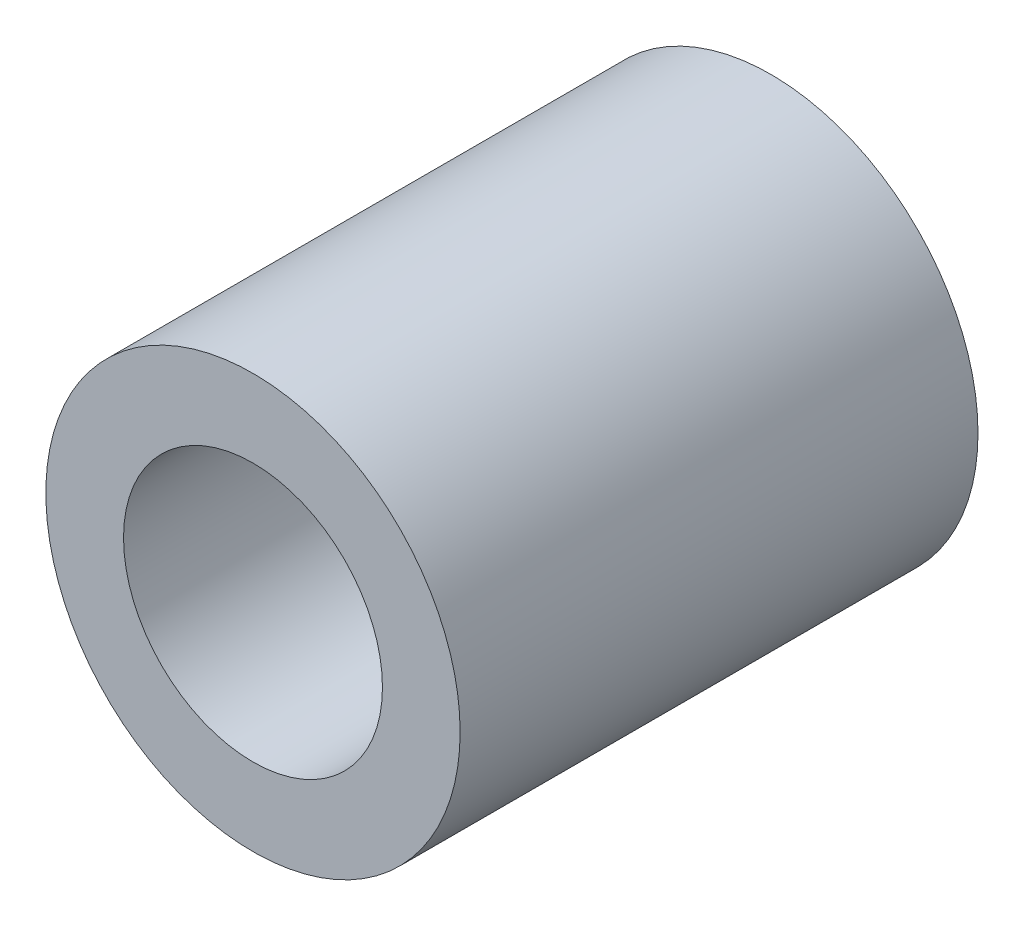
ISO-10303-21;
HEADER;
FILE_DESCRIPTION(('STEP AP214'),'2;1');
FILE_NAME('part.step','',(''),(''),'','','');
FILE_SCHEMA(('AUTOMOTIVE_DESIGN { 1 0 10303 214 1 1 1 1 }'));
ENDSEC;
DATA;
#1=APPLICATION_CONTEXT('core data for automotive mechanical design processes');
#2=APPLICATION_PROTOCOL_DEFINITION('international standard','automotive_design',2000,#1);
#3=PRODUCT_CONTEXT('',#1,'mechanical');
#4=PRODUCT('Part','Part','',(#3));
#5=PRODUCT_RELATED_PRODUCT_CATEGORY('part','',(#4));
#6=PRODUCT_DEFINITION_FORMATION('','',#4);
#7=PRODUCT_DEFINITION_CONTEXT('part definition',#1,'design');
#8=PRODUCT_DEFINITION('design','',#6,#7);
#9=PRODUCT_DEFINITION_SHAPE('','',#8);
#10=(LENGTH_UNIT() NAMED_UNIT(*) SI_UNIT(.MILLI.,.METRE.));
#11=(NAMED_UNIT(*) PLANE_ANGLE_UNIT() SI_UNIT($,.RADIAN.));
#12=(NAMED_UNIT(*) SI_UNIT($,.STERADIAN.) SOLID_ANGLE_UNIT());
#13=UNCERTAINTY_MEASURE_WITH_UNIT(LENGTH_MEASURE(1.E-05),#10,'distance_accuracy_value','');
#14=(GEOMETRIC_REPRESENTATION_CONTEXT(3) GLOBAL_UNCERTAINTY_ASSIGNED_CONTEXT((#13)) GLOBAL_UNIT_ASSIGNED_CONTEXT((#10,
#11,#12)) REPRESENTATION_CONTEXT('',''));
#15=CARTESIAN_POINT('',(0.,0.,0.));
#16=DIRECTION('',(0.,0.,1.));
#17=DIRECTION('',(1.,0.,0.));
#18=AXIS2_PLACEMENT_3D('',#15,#16,#17);
#19=CARTESIAN_POINT('',(0.,0.,10.));
#20=DIRECTION('',(0.,0.,1.));
#21=DIRECTION('',(1.,0.,0.));
#22=AXIS2_PLACEMENT_3D('',#19,#20,#21);
#23=PLANE('',#22);
#24=CARTESIAN_POINT('',(0.,0.,10.));
#25=DIRECTION('',(0.,0.,1.));
#26=DIRECTION('',(1.,0.,0.));
#27=AXIS2_PLACEMENT_3D('',#24,#25,#26);
#28=CIRCLE('',#27,4.);
#29=CARTESIAN_POINT('',(4.,0.,10.));
#30=VERTEX_POINT('',#29);
#31=EDGE_CURVE('E10',#30,#30,#28,.T.);
#32=ORIENTED_EDGE('',*,*,#31,.T.);
#33=EDGE_LOOP('',(#32));
#34=FACE_BOUND('',#33,.T.);
#35=CARTESIAN_POINT('',(0.,0.,10.));
#36=DIRECTION('',(0.,0.,1.));
#37=DIRECTION('',(1.,0.,0.));
#38=AXIS2_PLACEMENT_3D('',#35,#36,#37);
#39=CIRCLE('',#38,2.5);
#40=CARTESIAN_POINT('',(2.5,0.,10.));
#41=VERTEX_POINT('',#40);
#42=EDGE_CURVE('E42',#41,#41,#39,.T.);
#43=ORIENTED_EDGE('',*,*,#42,.F.);
#44=EDGE_LOOP('',(#43));
#45=FACE_BOUND('',#44,.T.);
#46=ADVANCED_FACE('F31',(#34,#45),#23,.T.);
#47=CARTESIAN_POINT('',(0.,0.,0.));
#48=DIRECTION('',(0.,0.,1.));
#49=DIRECTION('',(1.,0.,0.));
#50=AXIS2_PLACEMENT_3D('',#47,#48,#49);
#51=PLANE('',#50);
#52=CARTESIAN_POINT('',(0.,0.,0.));
#53=DIRECTION('',(0.,0.,1.));
#54=DIRECTION('',(1.,0.,0.));
#55=AXIS2_PLACEMENT_3D('',#52,#53,#54);
#56=CIRCLE('',#55,4.);
#57=CARTESIAN_POINT('',(4.,0.,0.));
#58=VERTEX_POINT('',#57);
#59=EDGE_CURVE('E35',#58,#58,#56,.T.);
#60=ORIENTED_EDGE('',*,*,#59,.F.);
#61=EDGE_LOOP('',(#60));
#62=FACE_BOUND('',#61,.T.);
#63=CARTESIAN_POINT('',(0.,0.,0.));
#64=DIRECTION('',(0.,0.,1.));
#65=DIRECTION('',(1.,0.,0.));
#66=AXIS2_PLACEMENT_3D('',#63,#64,#65);
#67=CIRCLE('',#66,2.5);
#68=CARTESIAN_POINT('',(2.5,0.,0.));
#69=VERTEX_POINT('',#68);
#70=EDGE_CURVE('E44',#69,#69,#67,.T.);
#71=ORIENTED_EDGE('',*,*,#70,.T.);
#72=EDGE_LOOP('',(#71));
#73=FACE_BOUND('',#72,.T.);
#74=ADVANCED_FACE('F54',(#62,#73),#51,.F.);
#75=CARTESIAN_POINT('',(0.,0.,10.));
#76=DIRECTION('',(0.,0.,-1.));
#77=DIRECTION('',(-1.,0.,0.));
#78=AXIS2_PLACEMENT_3D('',#75,#76,#77);
#79=CYLINDRICAL_SURFACE('',#78,4.);
#80=ORIENTED_EDGE('',*,*,#31,.F.);
#81=EDGE_LOOP('',(#80));
#82=FACE_BOUND('',#81,.T.);
#83=ORIENTED_EDGE('',*,*,#59,.T.);
#84=EDGE_LOOP('',(#83));
#85=FACE_BOUND('',#84,.T.);
#86=ADVANCED_FACE('F33',(#82,#85),#79,.T.);
#87=CARTESIAN_POINT('',(0.,0.,10.));
#88=DIRECTION('',(0.,0.,-1.));
#89=DIRECTION('',(-1.,0.,0.));
#90=AXIS2_PLACEMENT_3D('',#87,#88,#89);
#91=CYLINDRICAL_SURFACE('',#90,2.5);
#92=ORIENTED_EDGE('',*,*,#42,.T.);
#93=EDGE_LOOP('',(#92));
#94=FACE_BOUND('',#93,.T.);
#95=ORIENTED_EDGE('',*,*,#70,.F.);
#96=EDGE_LOOP('',(#95));
#97=FACE_BOUND('',#96,.T.);
#98=ADVANCED_FACE('F50',(#94,#97),#91,.F.);
#99=CLOSED_SHELL('',(#46,#74,#86,#98));
#100=MANIFOLD_SOLID_BREP('B2',#99);
#101=ADVANCED_BREP_SHAPE_REPRESENTATION('',(#18,#100),#14);
#102=SHAPE_DEFINITION_REPRESENTATION(#9,#101);
ENDSEC;
END-ISO-10303-21;
